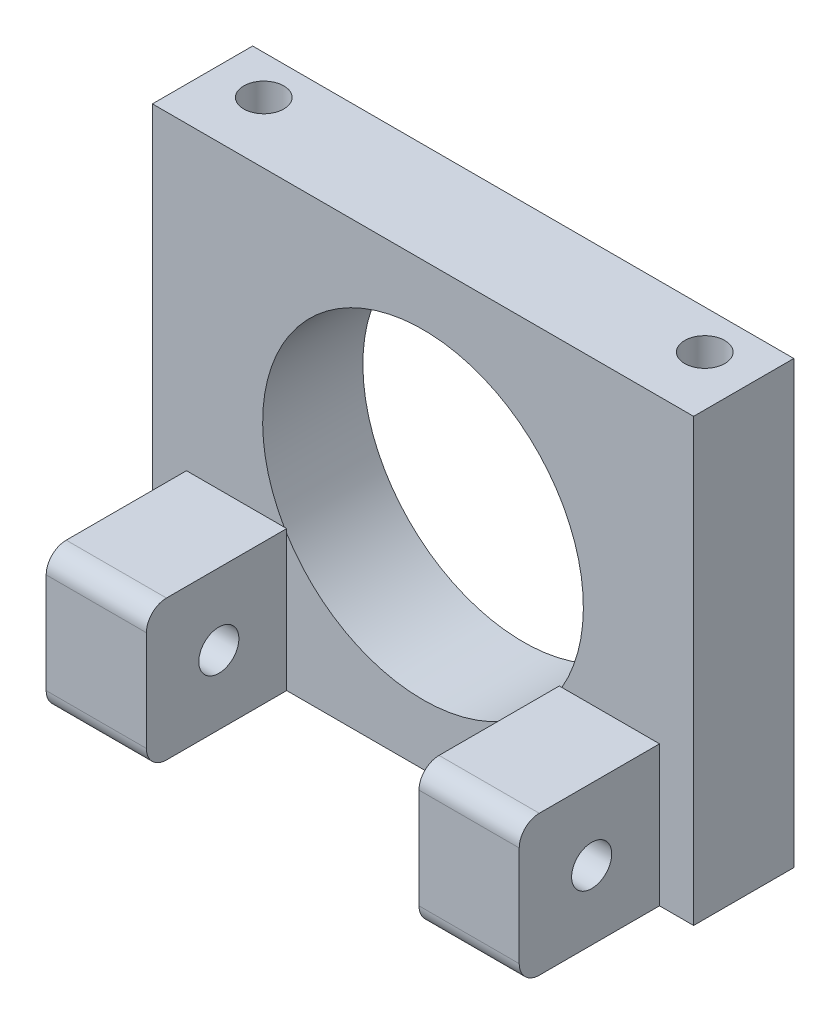
ISO-10303-21;
HEADER;
FILE_DESCRIPTION(('STEP AP214'),'2;1');
FILE_NAME('part.step','',(''),(''),'','','');
FILE_SCHEMA(('AUTOMOTIVE_DESIGN { 1 0 10303 214 1 1 1 1 }'));
ENDSEC;
DATA;
#1=APPLICATION_CONTEXT('core data for automotive mechanical design processes');
#2=APPLICATION_PROTOCOL_DEFINITION('international standard','automotive_design',2000,#1);
#3=PRODUCT_CONTEXT('',#1,'mechanical');
#4=PRODUCT('Part','Part','',(#3));
#5=PRODUCT_RELATED_PRODUCT_CATEGORY('part','',(#4));
#6=PRODUCT_DEFINITION_FORMATION('','',#4);
#7=PRODUCT_DEFINITION_CONTEXT('part definition',#1,'design');
#8=PRODUCT_DEFINITION('design','',#6,#7);
#9=PRODUCT_DEFINITION_SHAPE('','',#8);
#10=(LENGTH_UNIT() NAMED_UNIT(*) SI_UNIT(.MILLI.,.METRE.));
#11=(NAMED_UNIT(*) PLANE_ANGLE_UNIT() SI_UNIT($,.RADIAN.));
#12=(NAMED_UNIT(*) SI_UNIT($,.STERADIAN.) SOLID_ANGLE_UNIT());
#13=UNCERTAINTY_MEASURE_WITH_UNIT(LENGTH_MEASURE(1.E-05),#10,'distance_accuracy_value','');
#14=(GEOMETRIC_REPRESENTATION_CONTEXT(3) GLOBAL_UNCERTAINTY_ASSIGNED_CONTEXT((#13)) GLOBAL_UNIT_ASSIGNED_CONTEXT((#10,
#11,#12)) REPRESENTATION_CONTEXT('',''));
#15=CARTESIAN_POINT('',(0.,0.,0.));
#16=DIRECTION('',(0.,0.,1.));
#17=DIRECTION('',(1.,0.,0.));
#18=AXIS2_PLACEMENT_3D('',#15,#16,#17);
#19=CARTESIAN_POINT('',(0.,0.,5.));
#20=DIRECTION('',(0.,0.,1.));
#21=DIRECTION('',(1.,0.,0.));
#22=AXIS2_PLACEMENT_3D('',#19,#20,#21);
#23=PLANE('',#22);
#24=DIRECTION('',(1.,0.,0.));
#25=VECTOR('',#24,1.);
#26=CARTESIAN_POINT('',(-13.5,-11.,5.));
#27=LINE('',#26,#25);
#28=CARTESIAN_POINT('',(-6.8,-11.,5.));
#29=VERTEX_POINT('',#28);
#30=CARTESIAN_POINT('',(6.8,-11.,5.));
#31=VERTEX_POINT('',#30);
#32=EDGE_CURVE('E268',#29,#31,#27,.T.);
#33=ORIENTED_EDGE('',*,*,#32,.T.);
#34=DIRECTION('',(0.,-1.,0.));
#35=VECTOR('',#34,1.);
#36=CARTESIAN_POINT('',(6.8,-11.,5.));
#37=LINE('',#36,#35);
#38=CARTESIAN_POINT('',(6.8,-4.21426150114109,5.));
#39=VERTEX_POINT('',#38);
#40=EDGE_CURVE('E196',#39,#31,#37,.T.);
#41=ORIENTED_EDGE('',*,*,#40,.F.);
#42=CARTESIAN_POINT('',(0.,0.,5.));
#43=DIRECTION('',(0.,0.,1.));
#44=DIRECTION('',(1.,0.,0.));
#45=AXIS2_PLACEMENT_3D('',#42,#43,#44);
#46=CIRCLE('',#45,8.);
#47=CARTESIAN_POINT('',(-6.8,-4.2142615011411,5.));
#48=VERTEX_POINT('',#47);
#49=EDGE_CURVE('E246',#48,#39,#46,.T.);
#50=ORIENTED_EDGE('',*,*,#49,.F.);
#51=DIRECTION('',(0.,1.,0.));
#52=VECTOR('',#51,1.);
#53=CARTESIAN_POINT('',(-6.8,-11.,5.));
#54=LINE('',#53,#52);
#55=EDGE_CURVE('E222',#29,#48,#54,.T.);
#56=ORIENTED_EDGE('',*,*,#55,.F.);
#57=EDGE_LOOP('',(#33,#41,#50,#56));
#58=FACE_BOUND('',#57,.T.);
#59=ADVANCED_FACE('F42',(#58),#23,.T.);
#60=DIRECTION('',(-1.,0.,0.));
#61=VECTOR('',#60,1.);
#62=CARTESIAN_POINT('',(6.8,-4.,5.));
#63=LINE('',#62,#61);
#64=CARTESIAN_POINT('',(11.8,-4.,5.));
#65=VERTEX_POINT('',#64);
#66=CARTESIAN_POINT('',(6.92820323027551,-4.,5.));
#67=VERTEX_POINT('',#66);
#68=EDGE_CURVE('E185',#65,#67,#63,.T.);
#69=ORIENTED_EDGE('',*,*,#68,.F.);
#70=DIRECTION('',(0.,1.,0.));
#71=VECTOR('',#70,1.);
#72=CARTESIAN_POINT('',(11.8,-11.,5.));
#73=LINE('',#72,#71);
#74=CARTESIAN_POINT('',(11.8,-11.,5.));
#75=VERTEX_POINT('',#74);
#76=EDGE_CURVE('E203',#75,#65,#73,.T.);
#77=ORIENTED_EDGE('',*,*,#76,.F.);
#78=CARTESIAN_POINT('',(13.5,-11.,5.));
#79=VERTEX_POINT('',#78);
#80=EDGE_CURVE('E262',#75,#79,#27,.T.);
#81=ORIENTED_EDGE('',*,*,#80,.T.);
#82=DIRECTION('',(0.,1.,0.));
#83=VECTOR('',#82,1.);
#84=CARTESIAN_POINT('',(13.5,11.,5.));
#85=LINE('',#84,#83);
#86=CARTESIAN_POINT('',(13.5,11.,5.));
#87=VERTEX_POINT('',#86);
#88=EDGE_CURVE('E251',#79,#87,#85,.T.);
#89=ORIENTED_EDGE('',*,*,#88,.T.);
#90=DIRECTION('',(-1.,0.,0.));
#91=VECTOR('',#90,1.);
#92=CARTESIAN_POINT('',(-13.5,11.,5.));
#93=LINE('',#92,#91);
#94=CARTESIAN_POINT('',(-13.5,11.,5.));
#95=VERTEX_POINT('',#94);
#96=EDGE_CURVE('E255',#87,#95,#93,.T.);
#97=ORIENTED_EDGE('',*,*,#96,.T.);
#98=DIRECTION('',(0.,-1.,0.));
#99=VECTOR('',#98,1.);
#100=CARTESIAN_POINT('',(-13.5,11.,5.));
#101=LINE('',#100,#99);
#102=CARTESIAN_POINT('',(-13.5,-11.,5.));
#103=VERTEX_POINT('',#102);
#104=EDGE_CURVE('E259',#95,#103,#101,.T.);
#105=ORIENTED_EDGE('',*,*,#104,.T.);
#106=CARTESIAN_POINT('',(-11.8,-11.,5.));
#107=VERTEX_POINT('',#106);
#108=EDGE_CURVE('E263',#103,#107,#27,.T.);
#109=ORIENTED_EDGE('',*,*,#108,.T.);
#110=DIRECTION('',(0.,-1.,0.));
#111=VECTOR('',#110,1.);
#112=CARTESIAN_POINT('',(-11.8,-11.,5.));
#113=LINE('',#112,#111);
#114=CARTESIAN_POINT('',(-11.8,-4.,5.));
#115=VERTEX_POINT('',#114);
#116=EDGE_CURVE('E195',#115,#107,#113,.T.);
#117=ORIENTED_EDGE('',*,*,#116,.F.);
#118=DIRECTION('',(-1.,0.,0.));
#119=VECTOR('',#118,1.);
#120=CARTESIAN_POINT('',(-11.8,-4.,5.));
#121=LINE('',#120,#119);
#122=CARTESIAN_POINT('',(-6.92820323027551,-4.,5.));
#123=VERTEX_POINT('',#122);
#124=EDGE_CURVE('E229',#123,#115,#121,.T.);
#125=ORIENTED_EDGE('',*,*,#124,.F.);
#126=EDGE_CURVE('E247',#67,#123,#46,.T.);
#127=ORIENTED_EDGE('',*,*,#126,.F.);
#128=EDGE_LOOP('',(#69,#77,#81,#89,#97,#105,#109,#117,#125,#127));
#129=FACE_BOUND('',#128,.T.);
#130=ADVANCED_FACE('F374',(#129),#23,.T.);
#131=CARTESIAN_POINT('',(0.,0.,0.));
#132=DIRECTION('',(0.,0.,1.));
#133=DIRECTION('',(1.,0.,0.));
#134=AXIS2_PLACEMENT_3D('',#131,#132,#133);
#135=PLANE('',#134);
#136=DIRECTION('',(0.,1.,0.));
#137=VECTOR('',#136,1.);
#138=CARTESIAN_POINT('',(13.5,11.,0.));
#139=LINE('',#138,#137);
#140=CARTESIAN_POINT('',(13.5,-11.,0.));
#141=VERTEX_POINT('',#140);
#142=CARTESIAN_POINT('',(13.5,11.,0.));
#143=VERTEX_POINT('',#142);
#144=EDGE_CURVE('E245',#141,#143,#139,.T.);
#145=ORIENTED_EDGE('',*,*,#144,.F.);
#146=DIRECTION('',(1.,0.,0.));
#147=VECTOR('',#146,1.);
#148=CARTESIAN_POINT('',(-13.5,-11.,0.));
#149=LINE('',#148,#147);
#150=CARTESIAN_POINT('',(-13.5,-11.,0.));
#151=VERTEX_POINT('',#150);
#152=EDGE_CURVE('E256',#151,#141,#149,.T.);
#153=ORIENTED_EDGE('',*,*,#152,.F.);
#154=DIRECTION('',(0.,-1.,0.));
#155=VECTOR('',#154,1.);
#156=CARTESIAN_POINT('',(-13.5,11.,0.));
#157=LINE('',#156,#155);
#158=CARTESIAN_POINT('',(-13.5,11.,0.));
#159=VERTEX_POINT('',#158);
#160=EDGE_CURVE('E275',#159,#151,#157,.T.);
#161=ORIENTED_EDGE('',*,*,#160,.F.);
#162=DIRECTION('',(-1.,0.,0.));
#163=VECTOR('',#162,1.);
#164=CARTESIAN_POINT('',(-13.5,11.,0.));
#165=LINE('',#164,#163);
#166=EDGE_CURVE('E272',#143,#159,#165,.T.);
#167=ORIENTED_EDGE('',*,*,#166,.F.);
#168=EDGE_LOOP('',(#145,#153,#161,#167));
#169=FACE_BOUND('',#168,.T.);
#170=CARTESIAN_POINT('',(0.,0.,0.));
#171=DIRECTION('',(0.,0.,1.));
#172=DIRECTION('',(1.,0.,0.));
#173=AXIS2_PLACEMENT_3D('',#170,#171,#172);
#174=CIRCLE('',#173,8.);
#175=CARTESIAN_POINT('',(8.,0.,0.));
#176=VERTEX_POINT('',#175);
#177=EDGE_CURVE('E241',#176,#176,#174,.T.);
#178=ORIENTED_EDGE('',*,*,#177,.T.);
#179=EDGE_LOOP('',(#178));
#180=FACE_BOUND('',#179,.T.);
#181=ADVANCED_FACE('F393',(#169,#180),#135,.F.);
#182=CARTESIAN_POINT('',(13.5,11.,5.));
#183=DIRECTION('',(-1.,0.,0.));
#184=DIRECTION('',(0.,-1.,0.));
#185=AXIS2_PLACEMENT_3D('',#182,#183,#184);
#186=PLANE('',#185);
#187=ORIENTED_EDGE('',*,*,#144,.T.);
#188=DIRECTION('',(0.,0.,-1.));
#189=VECTOR('',#188,1.);
#190=CARTESIAN_POINT('',(13.5,11.,5.));
#191=LINE('',#190,#189);
#192=EDGE_CURVE('E291',#87,#143,#191,.T.);
#193=ORIENTED_EDGE('',*,*,#192,.F.);
#194=ORIENTED_EDGE('',*,*,#88,.F.);
#195=DIRECTION('',(0.,0.,-1.));
#196=VECTOR('',#195,1.);
#197=CARTESIAN_POINT('',(13.5,-11.,5.));
#198=LINE('',#197,#196);
#199=EDGE_CURVE('E267',#79,#141,#198,.T.);
#200=ORIENTED_EDGE('',*,*,#199,.T.);
#201=EDGE_LOOP('',(#187,#193,#194,#200));
#202=FACE_BOUND('',#201,.T.);
#203=ADVANCED_FACE('F381',(#202),#186,.F.);
#204=CARTESIAN_POINT('',(-13.5,11.,5.));
#205=DIRECTION('',(0.,-1.,0.));
#206=DIRECTION('',(0.,0.,-1.));
#207=AXIS2_PLACEMENT_3D('',#204,#205,#206);
#208=PLANE('',#207);
#209=CARTESIAN_POINT('',(-11.,11.,1.94437067814429));
#210=DIRECTION('',(0.,1.,0.));
#211=DIRECTION('',(0.,0.,1.));
#212=AXIS2_PLACEMENT_3D('',#209,#210,#211);
#213=CIRCLE('',#212,1.);
#214=CARTESIAN_POINT('',(-11.,11.,2.94437067814429));
#215=VERTEX_POINT('',#214);
#216=EDGE_CURVE('E501',#215,#215,#213,.T.);
#217=ORIENTED_EDGE('',*,*,#216,.F.);
#218=EDGE_LOOP('',(#217));
#219=FACE_BOUND('',#218,.T.);
#220=CARTESIAN_POINT('',(11.,11.,1.94437067814429));
#221=DIRECTION('',(0.,1.,0.));
#222=DIRECTION('',(0.,0.,1.));
#223=AXIS2_PLACEMENT_3D('',#220,#221,#222);
#224=CIRCLE('',#223,1.);
#225=CARTESIAN_POINT('',(11.,11.,2.94437067814429));
#226=VERTEX_POINT('',#225);
#227=EDGE_CURVE('E497',#226,#226,#224,.T.);
#228=ORIENTED_EDGE('',*,*,#227,.F.);
#229=EDGE_LOOP('',(#228));
#230=FACE_BOUND('',#229,.T.);
#231=ORIENTED_EDGE('',*,*,#166,.T.);
#232=DIRECTION('',(0.,0.,-1.));
#233=VECTOR('',#232,1.);
#234=CARTESIAN_POINT('',(-13.5,11.,5.));
#235=LINE('',#234,#233);
#236=EDGE_CURVE('E287',#95,#159,#235,.T.);
#237=ORIENTED_EDGE('',*,*,#236,.F.);
#238=ORIENTED_EDGE('',*,*,#96,.F.);
#239=ORIENTED_EDGE('',*,*,#192,.T.);
#240=EDGE_LOOP('',(#231,#237,#238,#239));
#241=FACE_BOUND('',#240,.T.);
#242=ADVANCED_FACE('F383',(#219,#230,#241),#208,.F.);
#243=CARTESIAN_POINT('',(-13.5,11.,5.));
#244=DIRECTION('',(1.,0.,0.));
#245=DIRECTION('',(0.,1.,0.));
#246=AXIS2_PLACEMENT_3D('',#243,#244,#245);
#247=PLANE('',#246);
#248=ORIENTED_EDGE('',*,*,#160,.T.);
#249=DIRECTION('',(0.,0.,-1.));
#250=VECTOR('',#249,1.);
#251=CARTESIAN_POINT('',(-13.5,-11.,5.));
#252=LINE('',#251,#250);
#253=EDGE_CURVE('E283',#103,#151,#252,.T.);
#254=ORIENTED_EDGE('',*,*,#253,.F.);
#255=ORIENTED_EDGE('',*,*,#104,.F.);
#256=ORIENTED_EDGE('',*,*,#236,.T.);
#257=EDGE_LOOP('',(#248,#254,#255,#256));
#258=FACE_BOUND('',#257,.T.);
#259=ADVANCED_FACE('F390',(#258),#247,.F.);
#260=CARTESIAN_POINT('',(-13.5,-11.,5.));
#261=DIRECTION('',(0.,1.,0.));
#262=DIRECTION('',(0.,0.,1.));
#263=AXIS2_PLACEMENT_3D('',#260,#261,#262);
#264=PLANE('',#263);
#265=CARTESIAN_POINT('',(-11.,-11.,1.94437067814429));
#266=DIRECTION('',(0.,1.,0.));
#267=DIRECTION('',(0.,0.,1.));
#268=AXIS2_PLACEMENT_3D('',#265,#266,#267);
#269=CIRCLE('',#268,1.);
#270=CARTESIAN_POINT('',(-11.,-11.,2.94437067814429));
#271=VERTEX_POINT('',#270);
#272=EDGE_CURVE('E492',#271,#271,#269,.T.);
#273=ORIENTED_EDGE('',*,*,#272,.T.);
#274=EDGE_LOOP('',(#273));
#275=FACE_BOUND('',#274,.T.);
#276=CARTESIAN_POINT('',(11.,-11.,1.94437067814429));
#277=DIRECTION('',(0.,1.,0.));
#278=DIRECTION('',(0.,0.,1.));
#279=AXIS2_PLACEMENT_3D('',#276,#277,#278);
#280=CIRCLE('',#279,1.);
#281=CARTESIAN_POINT('',(11.,-11.,2.94437067814429));
#282=VERTEX_POINT('',#281);
#283=EDGE_CURVE('E493',#282,#282,#280,.T.);
#284=ORIENTED_EDGE('',*,*,#283,.T.);
#285=EDGE_LOOP('',(#284));
#286=FACE_BOUND('',#285,.T.);
#287=DIRECTION('',(0.,0.,-1.));
#288=VECTOR('',#287,1.);
#289=CARTESIAN_POINT('',(11.8,-11.,12.));
#290=LINE('',#289,#288);
#291=CARTESIAN_POINT('',(11.8,-11.,11.));
#292=VERTEX_POINT('',#291);
#293=EDGE_CURVE('E463',#292,#75,#290,.T.);
#294=ORIENTED_EDGE('',*,*,#293,.F.);
#295=DIRECTION('',(1.,0.,0.));
#296=VECTOR('',#295,1.);
#297=CARTESIAN_POINT('',(-13.5,-11.,11.));
#298=LINE('',#297,#296);
#299=CARTESIAN_POINT('',(6.8,-11.,11.));
#300=VERTEX_POINT('',#299);
#301=EDGE_CURVE('E326',#292,#300,#298,.F.);
#302=ORIENTED_EDGE('',*,*,#301,.T.);
#303=DIRECTION('',(0.,0.,-1.));
#304=VECTOR('',#303,1.);
#305=CARTESIAN_POINT('',(6.8,-11.,12.));
#306=LINE('',#305,#304);
#307=EDGE_CURVE('E366',#300,#31,#306,.T.);
#308=ORIENTED_EDGE('',*,*,#307,.T.);
#309=ORIENTED_EDGE('',*,*,#32,.F.);
#310=DIRECTION('',(0.,0.,-1.));
#311=VECTOR('',#310,1.);
#312=CARTESIAN_POINT('',(-6.8,-11.,12.));
#313=LINE('',#312,#311);
#314=CARTESIAN_POINT('',(-6.8,-11.,11.));
#315=VERTEX_POINT('',#314);
#316=EDGE_CURVE('E235',#315,#29,#313,.T.);
#317=ORIENTED_EDGE('',*,*,#316,.F.);
#318=DIRECTION('',(1.,0.,0.));
#319=VECTOR('',#318,1.);
#320=CARTESIAN_POINT('',(-13.5,-11.,11.));
#321=LINE('',#320,#319);
#322=CARTESIAN_POINT('',(-11.8,-11.,11.));
#323=VERTEX_POINT('',#322);
#324=EDGE_CURVE('E323',#315,#323,#321,.F.);
#325=ORIENTED_EDGE('',*,*,#324,.T.);
#326=DIRECTION('',(0.,0.,-1.));
#327=VECTOR('',#326,1.);
#328=CARTESIAN_POINT('',(-11.8,-11.,12.));
#329=LINE('',#328,#327);
#330=EDGE_CURVE('E238',#323,#107,#329,.T.);
#331=ORIENTED_EDGE('',*,*,#330,.T.);
#332=ORIENTED_EDGE('',*,*,#108,.F.);
#333=ORIENTED_EDGE('',*,*,#253,.T.);
#334=ORIENTED_EDGE('',*,*,#152,.T.);
#335=ORIENTED_EDGE('',*,*,#199,.F.);
#336=ORIENTED_EDGE('',*,*,#80,.F.);
#337=EDGE_LOOP('',(#294,#302,#308,#309,#317,#325,#331,#332,#333,#334,#335,#336));
#338=FACE_BOUND('',#337,.T.);
#339=ADVANCED_FACE('F363',(#275,#286,#338),#264,.F.);
#340=CARTESIAN_POINT('',(0.,0.,5.));
#341=DIRECTION('',(0.,0.,-1.));
#342=DIRECTION('',(-1.,0.,0.));
#343=AXIS2_PLACEMENT_3D('',#340,#341,#342);
#344=CYLINDRICAL_SURFACE('',#343,8.);
#345=EDGE_CURVE('E242',#123,#48,#46,.T.);
#346=ORIENTED_EDGE('',*,*,#345,.T.);
#347=ORIENTED_EDGE('',*,*,#49,.T.);
#348=EDGE_CURVE('E193',#39,#67,#46,.T.);
#349=ORIENTED_EDGE('',*,*,#348,.T.);
#350=ORIENTED_EDGE('',*,*,#126,.T.);
#351=EDGE_LOOP('',(#346,#347,#349,#350));
#352=FACE_BOUND('',#351,.T.);
#353=ORIENTED_EDGE('',*,*,#177,.F.);
#354=EDGE_LOOP('',(#353));
#355=FACE_BOUND('',#354,.T.);
#356=ADVANCED_FACE('F399',(#352,#355),#344,.F.);
#357=CARTESIAN_POINT('',(0.,0.,5.));
#358=DIRECTION('',(0.,0.,-1.));
#359=DIRECTION('',(-1.,0.,0.));
#360=AXIS2_PLACEMENT_3D('',#357,#358,#359);
#361=PLANE('',#360);
#362=ORIENTED_EDGE('',*,*,#345,.F.);
#363=CARTESIAN_POINT('',(-6.8,-4.,5.));
#364=VERTEX_POINT('',#363);
#365=EDGE_CURVE('E217',#364,#123,#121,.T.);
#366=ORIENTED_EDGE('',*,*,#365,.F.);
#367=EDGE_CURVE('E201',#48,#364,#54,.T.);
#368=ORIENTED_EDGE('',*,*,#367,.F.);
#369=EDGE_LOOP('',(#362,#366,#368));
#370=FACE_BOUND('',#369,.T.);
#371=ADVANCED_FACE('F401',(#370),#361,.T.);
#372=CARTESIAN_POINT('',(-11.8,-11.,12.));
#373=DIRECTION('',(1.,0.,0.));
#374=DIRECTION('',(0.,1.,0.));
#375=AXIS2_PLACEMENT_3D('',#372,#373,#374);
#376=PLANE('',#375);
#377=CARTESIAN_POINT('',(-11.8,-7.56139055277473,8.38617652690025));
#378=DIRECTION('',(-1.,0.,0.));
#379=DIRECTION('',(0.,-1.,0.));
#380=AXIS2_PLACEMENT_3D('',#377,#378,#379);
#381=CIRCLE('',#380,1.);
#382=CARTESIAN_POINT('',(-11.8,-8.56139055277474,8.38617652690025));
#383=VERTEX_POINT('',#382);
#384=EDGE_CURVE('E300',#383,#383,#381,.T.);
#385=ORIENTED_EDGE('',*,*,#384,.F.);
#386=EDGE_LOOP('',(#385));
#387=FACE_BOUND('',#386,.T.);
#388=ORIENTED_EDGE('',*,*,#330,.F.);
#389=CARTESIAN_POINT('',(-11.8,-10.,11.));
#390=DIRECTION('',(1.,0.,0.));
#391=DIRECTION('',(0.,1.,0.));
#392=AXIS2_PLACEMENT_3D('',#389,#390,#391);
#393=CIRCLE('',#392,1.);
#394=CARTESIAN_POINT('',(-11.8,-10.,12.));
#395=VERTEX_POINT('',#394);
#396=EDGE_CURVE('E51',#323,#395,#393,.F.);
#397=ORIENTED_EDGE('',*,*,#396,.T.);
#398=DIRECTION('',(0.,-1.,0.));
#399=VECTOR('',#398,1.);
#400=CARTESIAN_POINT('',(-11.8,-11.,12.));
#401=LINE('',#400,#399);
#402=CARTESIAN_POINT('',(-11.8,-5.,12.));
#403=VERTEX_POINT('',#402);
#404=EDGE_CURVE('E212',#403,#395,#401,.T.);
#405=ORIENTED_EDGE('',*,*,#404,.F.);
#406=CARTESIAN_POINT('',(-11.8,-5.,11.));
#407=DIRECTION('',(1.,0.,0.));
#408=DIRECTION('',(0.,1.,0.));
#409=AXIS2_PLACEMENT_3D('',#406,#407,#408);
#410=CIRCLE('',#409,1.);
#411=CARTESIAN_POINT('',(-11.8,-4.,11.));
#412=VERTEX_POINT('',#411);
#413=EDGE_CURVE('E58',#403,#412,#410,.F.);
#414=ORIENTED_EDGE('',*,*,#413,.T.);
#415=DIRECTION('',(0.,0.,-1.));
#416=VECTOR('',#415,1.);
#417=CARTESIAN_POINT('',(-11.8,-4.,12.));
#418=LINE('',#417,#416);
#419=EDGE_CURVE('E220',#412,#115,#418,.T.);
#420=ORIENTED_EDGE('',*,*,#419,.T.);
#421=ORIENTED_EDGE('',*,*,#116,.T.);
#422=EDGE_LOOP('',(#388,#397,#405,#414,#420,#421));
#423=FACE_BOUND('',#422,.T.);
#424=ADVANCED_FACE('F347',(#387,#423),#376,.F.);
#425=CARTESIAN_POINT('',(-6.8,-11.,12.));
#426=DIRECTION('',(-1.,0.,0.));
#427=DIRECTION('',(0.,0.,1.));
#428=AXIS2_PLACEMENT_3D('',#425,#426,#427);
#429=PLANE('',#428);
#430=CARTESIAN_POINT('',(-6.8,-7.56139055277473,8.38617652690025));
#431=DIRECTION('',(-1.,0.,0.));
#432=DIRECTION('',(0.,0.,1.));
#433=AXIS2_PLACEMENT_3D('',#430,#431,#432);
#434=CIRCLE('',#433,1.);
#435=CARTESIAN_POINT('',(-6.8,-7.56139055277473,9.38617652690025));
#436=VERTEX_POINT('',#435);
#437=EDGE_CURVE('E464',#436,#436,#434,.T.);
#438=ORIENTED_EDGE('',*,*,#437,.T.);
#439=EDGE_LOOP('',(#438));
#440=FACE_BOUND('',#439,.T.);
#441=DIRECTION('',(0.,1.,0.));
#442=VECTOR('',#441,1.);
#443=CARTESIAN_POINT('',(-6.8,-11.,12.));
#444=LINE('',#443,#442);
#445=CARTESIAN_POINT('',(-6.8,-10.,12.));
#446=VERTEX_POINT('',#445);
#447=CARTESIAN_POINT('',(-6.8,-5.,12.));
#448=VERTEX_POINT('',#447);
#449=EDGE_CURVE('E216',#446,#448,#444,.T.);
#450=ORIENTED_EDGE('',*,*,#449,.F.);
#451=CARTESIAN_POINT('',(-6.8,-10.,11.));
#452=DIRECTION('',(-1.,0.,0.));
#453=DIRECTION('',(0.,0.,1.));
#454=AXIS2_PLACEMENT_3D('',#451,#452,#453);
#455=CIRCLE('',#454,1.);
#456=EDGE_CURVE('E340',#446,#315,#455,.F.);
#457=ORIENTED_EDGE('',*,*,#456,.T.);
#458=ORIENTED_EDGE('',*,*,#316,.T.);
#459=ORIENTED_EDGE('',*,*,#55,.T.);
#460=ORIENTED_EDGE('',*,*,#367,.T.);
#461=DIRECTION('',(0.,0.,-1.));
#462=VECTOR('',#461,1.);
#463=CARTESIAN_POINT('',(-6.8,-4.,12.));
#464=LINE('',#463,#462);
#465=CARTESIAN_POINT('',(-6.8,-4.,11.));
#466=VERTEX_POINT('',#465);
#467=EDGE_CURVE('E232',#466,#364,#464,.T.);
#468=ORIENTED_EDGE('',*,*,#467,.F.);
#469=CARTESIAN_POINT('',(-6.8,-5.,11.));
#470=DIRECTION('',(-1.,0.,0.));
#471=DIRECTION('',(0.,0.,1.));
#472=AXIS2_PLACEMENT_3D('',#469,#470,#471);
#473=CIRCLE('',#472,1.);
#474=EDGE_CURVE('E337',#466,#448,#473,.F.);
#475=ORIENTED_EDGE('',*,*,#474,.T.);
#476=EDGE_LOOP('',(#450,#457,#458,#459,#460,#468,#475));
#477=FACE_BOUND('',#476,.T.);
#478=ADVANCED_FACE('F358',(#440,#477),#429,.F.);
#479=CARTESIAN_POINT('',(-11.8,-4.,12.));
#480=DIRECTION('',(0.,-1.,0.));
#481=DIRECTION('',(0.,0.,-1.));
#482=AXIS2_PLACEMENT_3D('',#479,#480,#481);
#483=PLANE('',#482);
#484=ORIENTED_EDGE('',*,*,#419,.F.);
#485=DIRECTION('',(-1.,0.,0.));
#486=VECTOR('',#485,1.);
#487=CARTESIAN_POINT('',(-11.8,-4.,11.));
#488=LINE('',#487,#486);
#489=EDGE_CURVE('E11',#412,#466,#488,.F.);
#490=ORIENTED_EDGE('',*,*,#489,.T.);
#491=ORIENTED_EDGE('',*,*,#467,.T.);
#492=ORIENTED_EDGE('',*,*,#365,.T.);
#493=ORIENTED_EDGE('',*,*,#124,.T.);
#494=EDGE_LOOP('',(#484,#490,#491,#492,#493));
#495=FACE_BOUND('',#494,.T.);
#496=ADVANCED_FACE('F451',(#495),#483,.F.);
#497=CARTESIAN_POINT('',(0.,0.,12.));
#498=DIRECTION('',(0.,0.,-1.));
#499=DIRECTION('',(-1.,0.,0.));
#500=AXIS2_PLACEMENT_3D('',#497,#498,#499);
#501=PLANE('',#500);
#502=ORIENTED_EDGE('',*,*,#404,.T.);
#503=DIRECTION('',(1.,0.,0.));
#504=VECTOR('',#503,1.);
#505=CARTESIAN_POINT('',(0.,-10.,12.));
#506=LINE('',#505,#504);
#507=EDGE_CURVE('E333',#395,#446,#506,.T.);
#508=ORIENTED_EDGE('',*,*,#507,.T.);
#509=ORIENTED_EDGE('',*,*,#449,.T.);
#510=DIRECTION('',(-1.,0.,0.));
#511=VECTOR('',#510,1.);
#512=CARTESIAN_POINT('',(0.,-5.,12.));
#513=LINE('',#512,#511);
#514=EDGE_CURVE('E329',#448,#403,#513,.T.);
#515=ORIENTED_EDGE('',*,*,#514,.T.);
#516=EDGE_LOOP('',(#502,#508,#509,#515));
#517=FACE_BOUND('',#516,.T.);
#518=ADVANCED_FACE('F352',(#517),#501,.F.);
#519=CARTESIAN_POINT('',(0.,0.,5.));
#520=DIRECTION('',(0.,0.,-1.));
#521=DIRECTION('',(-1.,0.,0.));
#522=AXIS2_PLACEMENT_3D('',#519,#520,#521);
#523=PLANE('',#522);
#524=CARTESIAN_POINT('',(6.8,-4.,5.));
#525=VERTEX_POINT('',#524);
#526=EDGE_CURVE('E182',#67,#525,#63,.T.);
#527=ORIENTED_EDGE('',*,*,#526,.F.);
#528=ORIENTED_EDGE('',*,*,#348,.F.);
#529=EDGE_CURVE('E172',#525,#39,#37,.T.);
#530=ORIENTED_EDGE('',*,*,#529,.F.);
#531=EDGE_LOOP('',(#527,#528,#530));
#532=FACE_BOUND('',#531,.T.);
#533=ADVANCED_FACE('F191',(#532),#523,.T.);
#534=CARTESIAN_POINT('',(6.8,-11.,12.));
#535=DIRECTION('',(1.,0.,0.));
#536=DIRECTION('',(0.,0.,-1.));
#537=AXIS2_PLACEMENT_3D('',#534,#535,#536);
#538=PLANE('',#537);
#539=CARTESIAN_POINT('',(6.8,-7.56139055277473,8.38617652690025));
#540=DIRECTION('',(1.,0.,0.));
#541=DIRECTION('',(0.,0.,-1.));
#542=AXIS2_PLACEMENT_3D('',#539,#540,#541);
#543=CIRCLE('',#542,1.);
#544=CARTESIAN_POINT('',(6.8,-7.56139055277473,7.38617652690025));
#545=VERTEX_POINT('',#544);
#546=EDGE_CURVE('E299',#545,#545,#543,.T.);
#547=ORIENTED_EDGE('',*,*,#546,.T.);
#548=EDGE_LOOP('',(#547));
#549=FACE_BOUND('',#548,.T.);
#550=DIRECTION('',(0.,-1.,0.));
#551=VECTOR('',#550,1.);
#552=CARTESIAN_POINT('',(6.8,-11.,12.));
#553=LINE('',#552,#551);
#554=CARTESIAN_POINT('',(6.8,-5.,12.));
#555=VERTEX_POINT('',#554);
#556=CARTESIAN_POINT('',(6.8,-10.,12.));
#557=VERTEX_POINT('',#556);
#558=EDGE_CURVE('E189',#555,#557,#553,.T.);
#559=ORIENTED_EDGE('',*,*,#558,.F.);
#560=CARTESIAN_POINT('',(6.8,-5.,11.));
#561=DIRECTION('',(1.,0.,0.));
#562=DIRECTION('',(0.,0.,-1.));
#563=AXIS2_PLACEMENT_3D('',#560,#561,#562);
#564=CIRCLE('',#563,1.);
#565=CARTESIAN_POINT('',(6.8,-4.,11.));
#566=VERTEX_POINT('',#565);
#567=EDGE_CURVE('E174',#555,#566,#564,.F.);
#568=ORIENTED_EDGE('',*,*,#567,.T.);
#569=DIRECTION('',(0.,0.,-1.));
#570=VECTOR('',#569,1.);
#571=CARTESIAN_POINT('',(6.8,-4.,12.));
#572=LINE('',#571,#570);
#573=EDGE_CURVE('E166',#566,#525,#572,.T.);
#574=ORIENTED_EDGE('',*,*,#573,.T.);
#575=ORIENTED_EDGE('',*,*,#529,.T.);
#576=ORIENTED_EDGE('',*,*,#40,.T.);
#577=ORIENTED_EDGE('',*,*,#307,.F.);
#578=CARTESIAN_POINT('',(6.8,-10.,11.));
#579=DIRECTION('',(1.,0.,0.));
#580=DIRECTION('',(0.,0.,-1.));
#581=AXIS2_PLACEMENT_3D('',#578,#579,#580);
#582=CIRCLE('',#581,1.);
#583=EDGE_CURVE('E309',#300,#557,#582,.F.);
#584=ORIENTED_EDGE('',*,*,#583,.T.);
#585=EDGE_LOOP('',(#559,#568,#574,#575,#576,#577,#584));
#586=FACE_BOUND('',#585,.T.);
#587=ADVANCED_FACE('F169',(#549,#586),#538,.F.);
#588=CARTESIAN_POINT('',(11.8,-11.,12.));
#589=DIRECTION('',(-1.,0.,0.));
#590=DIRECTION('',(0.,-1.,0.));
#591=AXIS2_PLACEMENT_3D('',#588,#589,#590);
#592=PLANE('',#591);
#593=CARTESIAN_POINT('',(11.8,-7.56139055277473,8.38617652690025));
#594=DIRECTION('',(-1.,0.,0.));
#595=DIRECTION('',(0.,-1.,0.));
#596=AXIS2_PLACEMENT_3D('',#593,#594,#595);
#597=CIRCLE('',#596,1.);
#598=CARTESIAN_POINT('',(11.8,-8.56139055277473,8.38617652690025));
#599=VERTEX_POINT('',#598);
#600=EDGE_CURVE('E295',#599,#599,#597,.T.);
#601=ORIENTED_EDGE('',*,*,#600,.T.);
#602=EDGE_LOOP('',(#601));
#603=FACE_BOUND('',#602,.T.);
#604=DIRECTION('',(0.,0.,-1.));
#605=VECTOR('',#604,1.);
#606=CARTESIAN_POINT('',(11.8,-4.,12.));
#607=LINE('',#606,#605);
#608=CARTESIAN_POINT('',(11.8,-4.,11.));
#609=VERTEX_POINT('',#608);
#610=EDGE_CURVE('E179',#609,#65,#607,.T.);
#611=ORIENTED_EDGE('',*,*,#610,.F.);
#612=CARTESIAN_POINT('',(11.8,-5.,11.));
#613=DIRECTION('',(-1.,0.,0.));
#614=DIRECTION('',(0.,-1.,0.));
#615=AXIS2_PLACEMENT_3D('',#612,#613,#614);
#616=CIRCLE('',#615,1.);
#617=CARTESIAN_POINT('',(11.8,-5.,12.));
#618=VERTEX_POINT('',#617);
#619=EDGE_CURVE('E320',#609,#618,#616,.F.);
#620=ORIENTED_EDGE('',*,*,#619,.T.);
#621=DIRECTION('',(0.,1.,0.));
#622=VECTOR('',#621,1.);
#623=CARTESIAN_POINT('',(11.8,-11.,12.));
#624=LINE('',#623,#622);
#625=CARTESIAN_POINT('',(11.8,-10.,12.));
#626=VERTEX_POINT('',#625);
#627=EDGE_CURVE('E178',#626,#618,#624,.T.);
#628=ORIENTED_EDGE('',*,*,#627,.F.);
#629=CARTESIAN_POINT('',(11.8,-10.,11.));
#630=DIRECTION('',(-1.,0.,0.));
#631=DIRECTION('',(0.,-1.,0.));
#632=AXIS2_PLACEMENT_3D('',#629,#630,#631);
#633=CIRCLE('',#632,1.);
#634=EDGE_CURVE('E317',#626,#292,#633,.F.);
#635=ORIENTED_EDGE('',*,*,#634,.T.);
#636=ORIENTED_EDGE('',*,*,#293,.T.);
#637=ORIENTED_EDGE('',*,*,#76,.T.);
#638=EDGE_LOOP('',(#611,#620,#628,#635,#636,#637));
#639=FACE_BOUND('',#638,.T.);
#640=ADVANCED_FACE('F474',(#603,#639),#592,.F.);
#641=CARTESIAN_POINT('',(6.8,-4.,12.));
#642=DIRECTION('',(0.,-1.,0.));
#643=DIRECTION('',(0.,0.,-1.));
#644=AXIS2_PLACEMENT_3D('',#641,#642,#643);
#645=PLANE('',#644);
#646=ORIENTED_EDGE('',*,*,#573,.F.);
#647=DIRECTION('',(-1.,0.,0.));
#648=VECTOR('',#647,1.);
#649=CARTESIAN_POINT('',(6.8,-4.,11.));
#650=LINE('',#649,#648);
#651=EDGE_CURVE('E314',#566,#609,#650,.F.);
#652=ORIENTED_EDGE('',*,*,#651,.T.);
#653=ORIENTED_EDGE('',*,*,#610,.T.);
#654=ORIENTED_EDGE('',*,*,#68,.T.);
#655=ORIENTED_EDGE('',*,*,#526,.T.);
#656=EDGE_LOOP('',(#646,#652,#653,#654,#655));
#657=FACE_BOUND('',#656,.T.);
#658=ADVANCED_FACE('F183',(#657),#645,.F.);
#659=CARTESIAN_POINT('',(0.,0.,12.));
#660=DIRECTION('',(0.,0.,-1.));
#661=DIRECTION('',(-1.,0.,0.));
#662=AXIS2_PLACEMENT_3D('',#659,#660,#661);
#663=PLANE('',#662);
#664=ORIENTED_EDGE('',*,*,#627,.T.);
#665=DIRECTION('',(-1.,0.,0.));
#666=VECTOR('',#665,1.);
#667=CARTESIAN_POINT('',(0.,-5.,12.));
#668=LINE('',#667,#666);
#669=EDGE_CURVE('E305',#618,#555,#668,.T.);
#670=ORIENTED_EDGE('',*,*,#669,.T.);
#671=ORIENTED_EDGE('',*,*,#558,.T.);
#672=DIRECTION('',(1.,0.,0.));
#673=VECTOR('',#672,1.);
#674=CARTESIAN_POINT('',(0.,-10.,12.));
#675=LINE('',#674,#673);
#676=EDGE_CURVE('E301',#557,#626,#675,.T.);
#677=ORIENTED_EDGE('',*,*,#676,.T.);
#678=EDGE_LOOP('',(#664,#670,#671,#677));
#679=FACE_BOUND('',#678,.T.);
#680=ADVANCED_FACE('F470',(#679),#663,.F.);
#681=CARTESIAN_POINT('',(13.5,-7.56139055277473,8.38617652690025));
#682=DIRECTION('',(-1.,0.,0.));
#683=DIRECTION('',(0.,-1.,0.));
#684=AXIS2_PLACEMENT_3D('',#681,#682,#683);
#685=CYLINDRICAL_SURFACE('',#684,1.);
#686=ORIENTED_EDGE('',*,*,#600,.F.);
#687=EDGE_LOOP('',(#686));
#688=FACE_BOUND('',#687,.T.);
#689=ORIENTED_EDGE('',*,*,#546,.F.);
#690=EDGE_LOOP('',(#689));
#691=FACE_BOUND('',#690,.T.);
#692=ADVANCED_FACE('F522',(#688,#691),#685,.F.);
#693=ORIENTED_EDGE('',*,*,#384,.T.);
#694=EDGE_LOOP('',(#693));
#695=FACE_BOUND('',#694,.T.);
#696=ORIENTED_EDGE('',*,*,#437,.F.);
#697=EDGE_LOOP('',(#696));
#698=FACE_BOUND('',#697,.T.);
#699=ADVANCED_FACE('F431',(#695,#698),#685,.F.);
#700=CARTESIAN_POINT('',(0.,-5.,11.));
#701=DIRECTION('',(-1.,0.,0.));
#702=DIRECTION('',(0.,0.,1.));
#703=AXIS2_PLACEMENT_3D('',#700,#701,#702);
#704=CYLINDRICAL_SURFACE('',#703,1.);
#705=ORIENTED_EDGE('',*,*,#619,.F.);
#706=ORIENTED_EDGE('',*,*,#651,.F.);
#707=ORIENTED_EDGE('',*,*,#567,.F.);
#708=ORIENTED_EDGE('',*,*,#669,.F.);
#709=EDGE_LOOP('',(#705,#706,#707,#708));
#710=FACE_BOUND('',#709,.T.);
#711=ADVANCED_FACE('F427',(#710),#704,.T.);
#712=CARTESIAN_POINT('',(0.,-10.,11.));
#713=DIRECTION('',(1.,0.,0.));
#714=DIRECTION('',(0.,0.,-1.));
#715=AXIS2_PLACEMENT_3D('',#712,#713,#714);
#716=CYLINDRICAL_SURFACE('',#715,1.);
#717=ORIENTED_EDGE('',*,*,#583,.F.);
#718=ORIENTED_EDGE('',*,*,#301,.F.);
#719=ORIENTED_EDGE('',*,*,#634,.F.);
#720=ORIENTED_EDGE('',*,*,#676,.F.);
#721=EDGE_LOOP('',(#717,#718,#719,#720));
#722=FACE_BOUND('',#721,.T.);
#723=ADVANCED_FACE('F430',(#722),#716,.T.);
#724=CARTESIAN_POINT('',(0.,-10.,11.));
#725=DIRECTION('',(1.,0.,0.));
#726=DIRECTION('',(0.,0.,-1.));
#727=AXIS2_PLACEMENT_3D('',#724,#725,#726);
#728=CYLINDRICAL_SURFACE('',#727,1.);
#729=ORIENTED_EDGE('',*,*,#396,.F.);
#730=ORIENTED_EDGE('',*,*,#324,.F.);
#731=ORIENTED_EDGE('',*,*,#456,.F.);
#732=ORIENTED_EDGE('',*,*,#507,.F.);
#733=EDGE_LOOP('',(#729,#730,#731,#732));
#734=FACE_BOUND('',#733,.T.);
#735=ADVANCED_FACE('F355',(#734),#728,.T.);
#736=CARTESIAN_POINT('',(0.,-5.,11.));
#737=DIRECTION('',(-1.,0.,0.));
#738=DIRECTION('',(0.,0.,1.));
#739=AXIS2_PLACEMENT_3D('',#736,#737,#738);
#740=CYLINDRICAL_SURFACE('',#739,1.);
#741=ORIENTED_EDGE('',*,*,#474,.F.);
#742=ORIENTED_EDGE('',*,*,#489,.F.);
#743=ORIENTED_EDGE('',*,*,#413,.F.);
#744=ORIENTED_EDGE('',*,*,#514,.F.);
#745=EDGE_LOOP('',(#741,#742,#743,#744));
#746=FACE_BOUND('',#745,.T.);
#747=ADVANCED_FACE('F44',(#746),#740,.T.);
#748=CARTESIAN_POINT('',(11.,-11.,1.94437067814429));
#749=DIRECTION('',(0.,1.,0.));
#750=DIRECTION('',(0.,0.,1.));
#751=AXIS2_PLACEMENT_3D('',#748,#749,#750);
#752=CYLINDRICAL_SURFACE('',#751,1.);
#753=ORIENTED_EDGE('',*,*,#283,.F.);
#754=EDGE_LOOP('',(#753));
#755=FACE_BOUND('',#754,.T.);
#756=ORIENTED_EDGE('',*,*,#227,.T.);
#757=EDGE_LOOP('',(#756));
#758=FACE_BOUND('',#757,.T.);
#759=ADVANCED_FACE('F439',(#755,#758),#752,.F.);
#760=CARTESIAN_POINT('',(-11.,-11.,1.94437067814429));
#761=DIRECTION('',(0.,1.,0.));
#762=DIRECTION('',(0.,0.,1.));
#763=AXIS2_PLACEMENT_3D('',#760,#761,#762);
#764=CYLINDRICAL_SURFACE('',#763,1.);
#765=ORIENTED_EDGE('',*,*,#272,.F.);
#766=EDGE_LOOP('',(#765));
#767=FACE_BOUND('',#766,.T.);
#768=ORIENTED_EDGE('',*,*,#216,.T.);
#769=EDGE_LOOP('',(#768));
#770=FACE_BOUND('',#769,.T.);
#771=ADVANCED_FACE('F444',(#767,#770),#764,.F.);
#772=CLOSED_SHELL('',(#59,#130,#181,#203,#242,#259,#339,#356,#371,#424,#478,#496,#518,#533,#587,
#640,#658,#680,#692,#699,#711,#723,#735,#747,#759,#771));
#773=MANIFOLD_SOLID_BREP('B2',#772);
#774=ADVANCED_BREP_SHAPE_REPRESENTATION('',(#18,#773),#14);
#775=SHAPE_DEFINITION_REPRESENTATION(#9,#774);
ENDSEC;
END-ISO-10303-21;
